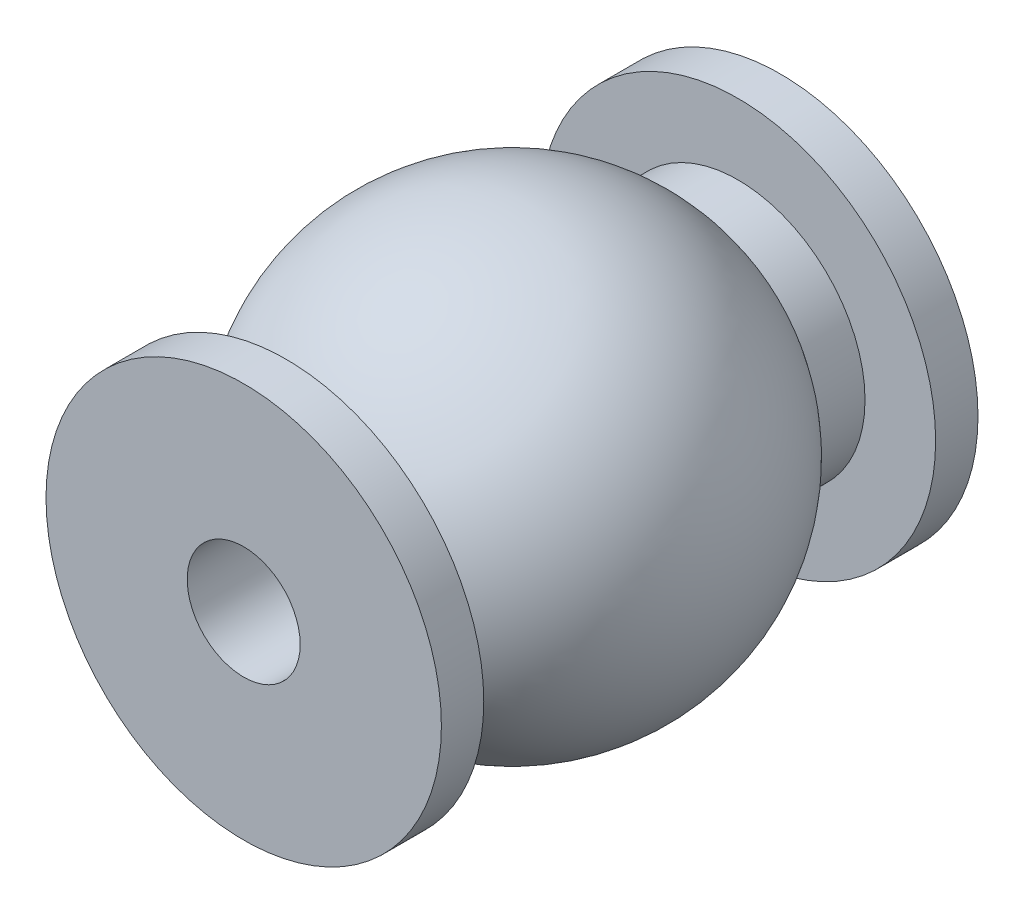
ISO-10303-21;
HEADER;
FILE_DESCRIPTION(('STEP AP214'),'2;1');
FILE_NAME('part.step','',(''),(''),'','','');
FILE_SCHEMA(('AUTOMOTIVE_DESIGN { 1 0 10303 214 1 1 1 1 }'));
ENDSEC;
DATA;
#1=APPLICATION_CONTEXT('core data for automotive mechanical design processes');
#2=APPLICATION_PROTOCOL_DEFINITION('international standard','automotive_design',2000,#1);
#3=PRODUCT_CONTEXT('',#1,'mechanical');
#4=PRODUCT('Part','Part','',(#3));
#5=PRODUCT_RELATED_PRODUCT_CATEGORY('part','',(#4));
#6=PRODUCT_DEFINITION_FORMATION('','',#4);
#7=PRODUCT_DEFINITION_CONTEXT('part definition',#1,'design');
#8=PRODUCT_DEFINITION('design','',#6,#7);
#9=PRODUCT_DEFINITION_SHAPE('','',#8);
#10=(LENGTH_UNIT() NAMED_UNIT(*) SI_UNIT(.MILLI.,.METRE.));
#11=(NAMED_UNIT(*) PLANE_ANGLE_UNIT() SI_UNIT($,.RADIAN.));
#12=(NAMED_UNIT(*) SI_UNIT($,.STERADIAN.) SOLID_ANGLE_UNIT());
#13=UNCERTAINTY_MEASURE_WITH_UNIT(LENGTH_MEASURE(1.E-05),#10,'distance_accuracy_value','');
#14=(GEOMETRIC_REPRESENTATION_CONTEXT(3) GLOBAL_UNCERTAINTY_ASSIGNED_CONTEXT((#13)) GLOBAL_UNIT_ASSIGNED_CONTEXT((#10,
#11,#12)) REPRESENTATION_CONTEXT('',''));
#15=CARTESIAN_POINT('',(0.,0.,0.));
#16=DIRECTION('',(0.,0.,1.));
#17=DIRECTION('',(1.,0.,0.));
#18=AXIS2_PLACEMENT_3D('',#15,#16,#17);
#19=CARTESIAN_POINT('',(-7.,0.,-8.));
#20=DIRECTION('',(0.,0.,-1.));
#21=DIRECTION('',(-1.,0.,0.));
#22=AXIS2_PLACEMENT_3D('',#19,#20,#21);
#23=PLANE('',#22);
#24=CARTESIAN_POINT('',(0.,0.,-8.));
#25=DIRECTION('',(0.,0.,1.));
#26=DIRECTION('',(1.,0.,0.));
#27=AXIS2_PLACEMENT_3D('',#24,#25,#26);
#28=CIRCLE('',#27,4.5);
#29=CARTESIAN_POINT('',(4.5,0.,-8.));
#30=VERTEX_POINT('',#29);
#31=EDGE_CURVE('E10',#30,#30,#28,.T.);
#32=ORIENTED_EDGE('',*,*,#31,.F.);
#33=EDGE_LOOP('',(#32));
#34=FACE_BOUND('',#33,.T.);
#35=CARTESIAN_POINT('',(0.,0.,-8.));
#36=DIRECTION('',(0.,0.,1.));
#37=DIRECTION('',(1.,0.,0.));
#38=AXIS2_PLACEMENT_3D('',#35,#36,#37);
#39=CIRCLE('',#38,7.);
#40=CARTESIAN_POINT('',(7.,0.,-8.));
#41=VERTEX_POINT('',#40);
#42=EDGE_CURVE('E63',#41,#41,#39,.T.);
#43=ORIENTED_EDGE('',*,*,#42,.T.);
#44=EDGE_LOOP('',(#43));
#45=FACE_BOUND('',#44,.T.);
#46=ADVANCED_FACE('F35',(#34,#45),#23,.F.);
#47=CARTESIAN_POINT('',(0.,0.,9.5));
#48=DIRECTION('',(0.,0.,1.));
#49=DIRECTION('',(1.,0.,0.));
#50=AXIS2_PLACEMENT_3D('',#47,#48,#49);
#51=CYLINDRICAL_SURFACE('',#50,4.5);
#52=CARTESIAN_POINT('',(0.,0.,-6.30971473206198));
#53=DIRECTION('',(0.,0.,1.));
#54=DIRECTION('',(1.,0.,0.));
#55=AXIS2_PLACEMENT_3D('',#52,#53,#54);
#56=CIRCLE('',#55,4.5);
#57=CARTESIAN_POINT('',(4.49999999999999,0.,-6.30971473206198));
#58=VERTEX_POINT('',#57);
#59=EDGE_CURVE('E41',#58,#58,#56,.T.);
#60=ORIENTED_EDGE('',*,*,#59,.F.);
#61=EDGE_LOOP('',(#60));
#62=FACE_BOUND('',#61,.T.);
#63=ORIENTED_EDGE('',*,*,#31,.T.);
#64=EDGE_LOOP('',(#63));
#65=FACE_BOUND('',#64,.T.);
#66=ADVANCED_FACE('F102',(#62,#65),#51,.T.);
#67=CARTESIAN_POINT('',(0.,0.,0.));
#68=DIRECTION('',(0.,0.,1.));
#69=DIRECTION('',(-1.,0.,0.));
#70=AXIS2_PLACEMENT_3D('',#67,#68,#69);
#71=SPHERICAL_SURFACE('',#70,7.75);
#72=CARTESIAN_POINT('',(0.,0.,6.30971473206198));
#73=DIRECTION('',(0.,0.,1.));
#74=DIRECTION('',(1.,0.,0.));
#75=AXIS2_PLACEMENT_3D('',#72,#73,#74);
#76=CIRCLE('',#75,4.49999999999999);
#77=CARTESIAN_POINT('',(4.49999999999999,0.,6.30971473206198));
#78=VERTEX_POINT('',#77);
#79=EDGE_CURVE('E45',#78,#78,#76,.T.);
#80=ORIENTED_EDGE('',*,*,#79,.F.);
#81=EDGE_LOOP('',(#80));
#82=FACE_BOUND('',#81,.T.);
#83=ORIENTED_EDGE('',*,*,#59,.T.);
#84=EDGE_LOOP('',(#83));
#85=FACE_BOUND('',#84,.T.);
#86=ADVANCED_FACE('F97',(#82,#85),#71,.T.);
#87=CARTESIAN_POINT('',(0.,0.,9.5));
#88=DIRECTION('',(0.,0.,1.));
#89=DIRECTION('',(1.,0.,0.));
#90=AXIS2_PLACEMENT_3D('',#87,#88,#89);
#91=CYLINDRICAL_SURFACE('',#90,4.49999999999999);
#92=CARTESIAN_POINT('',(0.,0.,8.));
#93=DIRECTION('',(0.,0.,1.));
#94=DIRECTION('',(1.,0.,0.));
#95=AXIS2_PLACEMENT_3D('',#92,#93,#94);
#96=CIRCLE('',#95,4.49999999999999);
#97=CARTESIAN_POINT('',(4.49999999999999,0.,8.));
#98=VERTEX_POINT('',#97);
#99=EDGE_CURVE('E49',#98,#98,#96,.T.);
#100=ORIENTED_EDGE('',*,*,#99,.F.);
#101=EDGE_LOOP('',(#100));
#102=FACE_BOUND('',#101,.T.);
#103=ORIENTED_EDGE('',*,*,#79,.T.);
#104=EDGE_LOOP('',(#103));
#105=FACE_BOUND('',#104,.T.);
#106=ADVANCED_FACE('F91',(#102,#105),#91,.T.);
#107=CARTESIAN_POINT('',(-7.,0.,8.));
#108=DIRECTION('',(0.,0.,1.));
#109=DIRECTION('',(1.,0.,0.));
#110=AXIS2_PLACEMENT_3D('',#107,#108,#109);
#111=PLANE('',#110);
#112=CARTESIAN_POINT('',(0.,0.,8.));
#113=DIRECTION('',(0.,0.,1.));
#114=DIRECTION('',(1.,0.,0.));
#115=AXIS2_PLACEMENT_3D('',#112,#113,#114);
#116=CIRCLE('',#115,7.);
#117=CARTESIAN_POINT('',(6.99999999999999,0.,8.));
#118=VERTEX_POINT('',#117);
#119=EDGE_CURVE('E54',#118,#118,#116,.T.);
#120=ORIENTED_EDGE('',*,*,#119,.F.);
#121=EDGE_LOOP('',(#120));
#122=FACE_BOUND('',#121,.T.);
#123=ORIENTED_EDGE('',*,*,#99,.T.);
#124=EDGE_LOOP('',(#123));
#125=FACE_BOUND('',#124,.T.);
#126=ADVANCED_FACE('F85',(#122,#125),#111,.F.);
#127=CARTESIAN_POINT('',(0.,0.,9.5));
#128=DIRECTION('',(0.,0.,1.));
#129=DIRECTION('',(1.,0.,0.));
#130=AXIS2_PLACEMENT_3D('',#127,#128,#129);
#131=CYLINDRICAL_SURFACE('',#130,7.);
#132=CARTESIAN_POINT('',(0.,0.,9.5));
#133=DIRECTION('',(0.,0.,1.));
#134=DIRECTION('',(1.,0.,0.));
#135=AXIS2_PLACEMENT_3D('',#132,#133,#134);
#136=CIRCLE('',#135,7.);
#137=CARTESIAN_POINT('',(6.99999999999999,0.,9.5));
#138=VERTEX_POINT('',#137);
#139=EDGE_CURVE('E57',#138,#138,#136,.T.);
#140=ORIENTED_EDGE('',*,*,#139,.F.);
#141=EDGE_LOOP('',(#140));
#142=FACE_BOUND('',#141,.T.);
#143=ORIENTED_EDGE('',*,*,#119,.T.);
#144=EDGE_LOOP('',(#143));
#145=FACE_BOUND('',#144,.T.);
#146=ADVANCED_FACE('F79',(#142,#145),#131,.T.);
#147=CARTESIAN_POINT('',(-7.,0.,9.5));
#148=DIRECTION('',(0.,0.,-1.));
#149=DIRECTION('',(-1.,0.,0.));
#150=AXIS2_PLACEMENT_3D('',#147,#148,#149);
#151=PLANE('',#150);
#152=CARTESIAN_POINT('',(0.,0.,9.5));
#153=DIRECTION('',(0.,0.,1.));
#154=DIRECTION('',(1.,0.,0.));
#155=AXIS2_PLACEMENT_3D('',#152,#153,#154);
#156=CIRCLE('',#155,2.);
#157=CARTESIAN_POINT('',(2.,0.,9.5));
#158=VERTEX_POINT('',#157);
#159=EDGE_CURVE('E69',#158,#158,#156,.T.);
#160=ORIENTED_EDGE('',*,*,#159,.F.);
#161=EDGE_LOOP('',(#160));
#162=FACE_BOUND('',#161,.T.);
#163=ORIENTED_EDGE('',*,*,#139,.T.);
#164=EDGE_LOOP('',(#163));
#165=FACE_BOUND('',#164,.T.);
#166=ADVANCED_FACE('F75',(#162,#165),#151,.F.);
#167=CARTESIAN_POINT('',(-7.,0.,-9.5));
#168=DIRECTION('',(0.,0.,1.));
#169=DIRECTION('',(1.,0.,0.));
#170=AXIS2_PLACEMENT_3D('',#167,#168,#169);
#171=PLANE('',#170);
#172=CARTESIAN_POINT('',(0.,0.,-9.5));
#173=DIRECTION('',(0.,0.,1.));
#174=DIRECTION('',(1.,0.,0.));
#175=AXIS2_PLACEMENT_3D('',#172,#173,#174);
#176=CIRCLE('',#175,2.);
#177=CARTESIAN_POINT('',(2.,0.,-9.5));
#178=VERTEX_POINT('',#177);
#179=EDGE_CURVE('E66',#178,#178,#176,.T.);
#180=ORIENTED_EDGE('',*,*,#179,.T.);
#181=EDGE_LOOP('',(#180));
#182=FACE_BOUND('',#181,.T.);
#183=CARTESIAN_POINT('',(0.,0.,-9.5));
#184=DIRECTION('',(0.,0.,1.));
#185=DIRECTION('',(1.,0.,0.));
#186=AXIS2_PLACEMENT_3D('',#183,#184,#185);
#187=CIRCLE('',#186,7.);
#188=CARTESIAN_POINT('',(7.,0.,-9.5));
#189=VERTEX_POINT('',#188);
#190=EDGE_CURVE('E60',#189,#189,#187,.T.);
#191=ORIENTED_EDGE('',*,*,#190,.F.);
#192=EDGE_LOOP('',(#191));
#193=FACE_BOUND('',#192,.T.);
#194=ADVANCED_FACE('F78',(#182,#193),#171,.F.);
#195=CARTESIAN_POINT('',(0.,0.,9.5));
#196=DIRECTION('',(0.,0.,1.));
#197=DIRECTION('',(1.,0.,0.));
#198=AXIS2_PLACEMENT_3D('',#195,#196,#197);
#199=CYLINDRICAL_SURFACE('',#198,7.);
#200=ORIENTED_EDGE('',*,*,#42,.F.);
#201=EDGE_LOOP('',(#200));
#202=FACE_BOUND('',#201,.T.);
#203=ORIENTED_EDGE('',*,*,#190,.T.);
#204=EDGE_LOOP('',(#203));
#205=FACE_BOUND('',#204,.T.);
#206=ADVANCED_FACE('F115',(#202,#205),#199,.T.);
#207=CARTESIAN_POINT('',(0.,0.,9.5));
#208=DIRECTION('',(0.,0.,1.));
#209=DIRECTION('',(1.,0.,0.));
#210=AXIS2_PLACEMENT_3D('',#207,#208,#209);
#211=CYLINDRICAL_SURFACE('',#210,2.);
#212=ORIENTED_EDGE('',*,*,#179,.F.);
#213=EDGE_LOOP('',(#212));
#214=FACE_BOUND('',#213,.T.);
#215=ORIENTED_EDGE('',*,*,#159,.T.);
#216=EDGE_LOOP('',(#215));
#217=FACE_BOUND('',#216,.T.);
#218=ADVANCED_FACE('F73',(#214,#217),#211,.F.);
#219=CLOSED_SHELL('',(#46,#66,#86,#106,#126,#146,#166,#194,#206,#218));
#220=MANIFOLD_SOLID_BREP('B2',#219);
#221=ADVANCED_BREP_SHAPE_REPRESENTATION('',(#18,#220),#14);
#222=SHAPE_DEFINITION_REPRESENTATION(#9,#221);
ENDSEC;
END-ISO-10303-21;
